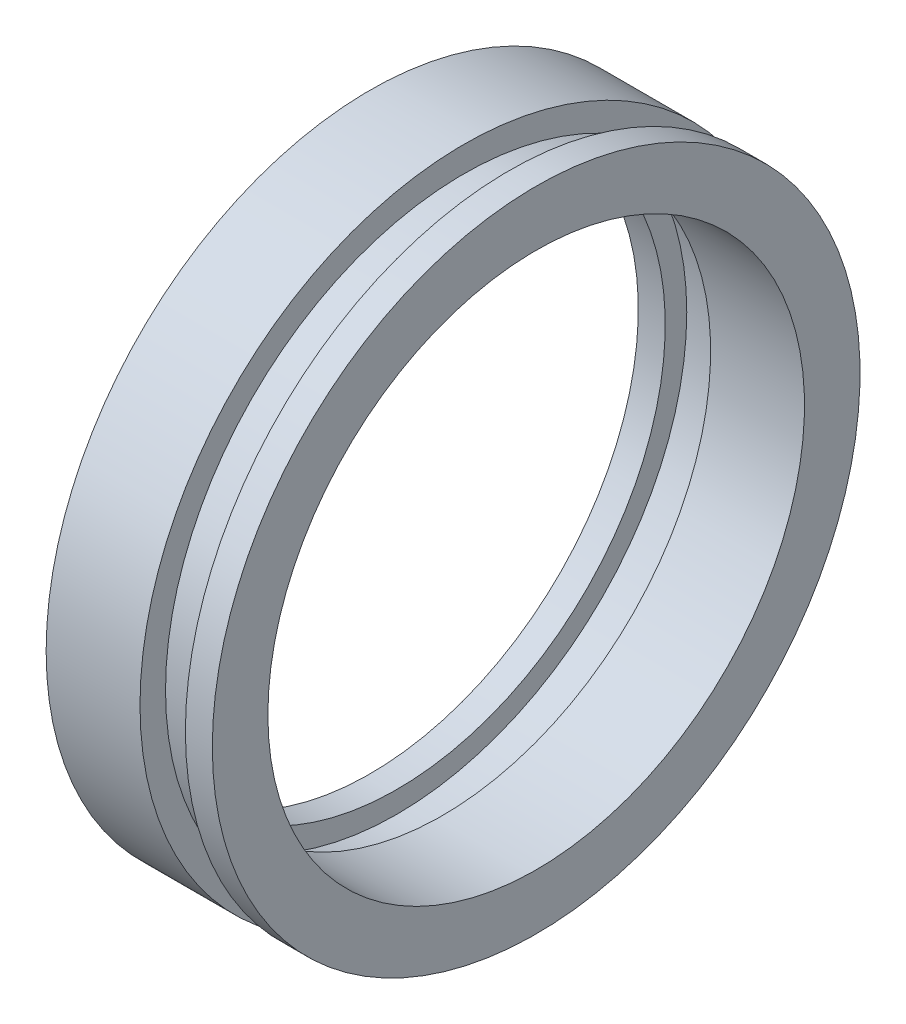
ISO-10303-21;
HEADER;
FILE_DESCRIPTION(('STEP AP214'),'2;1');
FILE_NAME('part.step','',(''),(''),'','','');
FILE_SCHEMA(('AUTOMOTIVE_DESIGN { 1 0 10303 214 1 1 1 1 }'));
ENDSEC;
DATA;
#1=APPLICATION_CONTEXT('core data for automotive mechanical design processes');
#2=APPLICATION_PROTOCOL_DEFINITION('international standard','automotive_design',2000,#1);
#3=PRODUCT_CONTEXT('',#1,'mechanical');
#4=PRODUCT('Part','Part','',(#3));
#5=PRODUCT_RELATED_PRODUCT_CATEGORY('part','',(#4));
#6=PRODUCT_DEFINITION_FORMATION('','',#4);
#7=PRODUCT_DEFINITION_CONTEXT('part definition',#1,'design');
#8=PRODUCT_DEFINITION('design','',#6,#7);
#9=PRODUCT_DEFINITION_SHAPE('','',#8);
#10=(LENGTH_UNIT() NAMED_UNIT(*) SI_UNIT(.MILLI.,.METRE.));
#11=(NAMED_UNIT(*) PLANE_ANGLE_UNIT() SI_UNIT($,.RADIAN.));
#12=(NAMED_UNIT(*) SI_UNIT($,.STERADIAN.) SOLID_ANGLE_UNIT());
#13=UNCERTAINTY_MEASURE_WITH_UNIT(LENGTH_MEASURE(1.E-05),#10,'distance_accuracy_value','');
#14=(GEOMETRIC_REPRESENTATION_CONTEXT(3) GLOBAL_UNCERTAINTY_ASSIGNED_CONTEXT((#13)) GLOBAL_UNIT_ASSIGNED_CONTEXT((#10,
#11,#12)) REPRESENTATION_CONTEXT('',''));
#15=CARTESIAN_POINT('',(0.,0.,0.));
#16=DIRECTION('',(0.,0.,1.));
#17=DIRECTION('',(1.,0.,0.));
#18=AXIS2_PLACEMENT_3D('',#15,#16,#17);
#19=CARTESIAN_POINT('',(0.,0.,0.));
#20=DIRECTION('',(-1.,0.,0.));
#21=DIRECTION('',(0.,0.,1.));
#22=AXIS2_PLACEMENT_3D('',#19,#20,#21);
#23=CYLINDRICAL_SURFACE('',#22,28.829);
#24=CARTESIAN_POINT('',(2.8956,0.,0.));
#25=DIRECTION('',(-1.,0.,0.));
#26=DIRECTION('',(0.,0.,1.));
#27=AXIS2_PLACEMENT_3D('',#24,#25,#26);
#28=CIRCLE('',#27,28.829);
#29=CARTESIAN_POINT('',(2.8956,0.,28.829));
#30=VERTEX_POINT('',#29);
#31=EDGE_CURVE('E76',#30,#30,#28,.T.);
#32=ORIENTED_EDGE('',*,*,#31,.F.);
#33=EDGE_LOOP('',(#32));
#34=FACE_BOUND('',#33,.T.);
#35=CARTESIAN_POINT('',(0.,0.,0.));
#36=DIRECTION('',(-1.,0.,0.));
#37=DIRECTION('',(0.,0.,1.));
#38=AXIS2_PLACEMENT_3D('',#35,#36,#37);
#39=CIRCLE('',#38,28.829);
#40=CARTESIAN_POINT('',(0.,0.,28.829));
#41=VERTEX_POINT('',#40);
#42=EDGE_CURVE('E10',#41,#41,#39,.T.);
#43=ORIENTED_EDGE('',*,*,#42,.T.);
#44=EDGE_LOOP('',(#43));
#45=FACE_BOUND('',#44,.T.);
#46=ADVANCED_FACE('F36',(#34,#45),#23,.F.);
#47=CARTESIAN_POINT('',(0.,28.829,0.));
#48=DIRECTION('',(1.,0.,0.));
#49=DIRECTION('',(0.,0.,-1.));
#50=AXIS2_PLACEMENT_3D('',#47,#48,#49);
#51=PLANE('',#50);
#52=ORIENTED_EDGE('',*,*,#42,.F.);
#53=EDGE_LOOP('',(#52));
#54=FACE_BOUND('',#53,.T.);
#55=CARTESIAN_POINT('',(0.,0.,0.));
#56=DIRECTION('',(-1.,0.,0.));
#57=DIRECTION('',(0.,0.,1.));
#58=AXIS2_PLACEMENT_3D('',#55,#56,#57);
#59=CIRCLE('',#58,34.798);
#60=CARTESIAN_POINT('',(0.,0.,34.798));
#61=VERTEX_POINT('',#60);
#62=EDGE_CURVE('E42',#61,#61,#59,.T.);
#63=ORIENTED_EDGE('',*,*,#62,.T.);
#64=EDGE_LOOP('',(#63));
#65=FACE_BOUND('',#64,.T.);
#66=ADVANCED_FACE('F83',(#54,#65),#51,.F.);
#67=CARTESIAN_POINT('',(0.,0.,0.));
#68=DIRECTION('',(-1.,0.,0.));
#69=DIRECTION('',(0.,0.,1.));
#70=AXIS2_PLACEMENT_3D('',#67,#68,#69);
#71=CYLINDRICAL_SURFACE('',#70,34.798);
#72=ORIENTED_EDGE('',*,*,#62,.F.);
#73=EDGE_LOOP('',(#72));
#74=FACE_BOUND('',#73,.T.);
#75=CARTESIAN_POINT('',(10.0838,0.,0.));
#76=DIRECTION('',(-1.,0.,0.));
#77=DIRECTION('',(0.,0.,1.));
#78=AXIS2_PLACEMENT_3D('',#75,#76,#77);
#79=CIRCLE('',#78,34.798);
#80=CARTESIAN_POINT('',(10.0838,0.,34.798));
#81=VERTEX_POINT('',#80);
#82=EDGE_CURVE('E46',#81,#81,#79,.T.);
#83=ORIENTED_EDGE('',*,*,#82,.T.);
#84=EDGE_LOOP('',(#83));
#85=FACE_BOUND('',#84,.T.);
#86=ADVANCED_FACE('F87',(#74,#85),#71,.T.);
#87=CARTESIAN_POINT('',(10.0838,34.798,0.));
#88=DIRECTION('',(-1.,0.,0.));
#89=DIRECTION('',(0.,0.,1.));
#90=AXIS2_PLACEMENT_3D('',#87,#88,#89);
#91=PLANE('',#90);
#92=ORIENTED_EDGE('',*,*,#82,.F.);
#93=EDGE_LOOP('',(#92));
#94=FACE_BOUND('',#93,.T.);
#95=CARTESIAN_POINT('',(10.0838,0.,0.));
#96=DIRECTION('',(-1.,0.,0.));
#97=DIRECTION('',(0.,0.,1.));
#98=AXIS2_PLACEMENT_3D('',#95,#96,#97);
#99=CIRCLE('',#98,32.0548);
#100=CARTESIAN_POINT('',(10.0838,0.,32.0548));
#101=VERTEX_POINT('',#100);
#102=EDGE_CURVE('E50',#101,#101,#99,.T.);
#103=ORIENTED_EDGE('',*,*,#102,.T.);
#104=EDGE_LOOP('',(#103));
#105=FACE_BOUND('',#104,.T.);
#106=ADVANCED_FACE('F92',(#94,#105),#91,.F.);
#107=CARTESIAN_POINT('',(0.,0.,0.));
#108=DIRECTION('',(-1.,0.,0.));
#109=DIRECTION('',(0.,0.,1.));
#110=AXIS2_PLACEMENT_3D('',#107,#108,#109);
#111=CYLINDRICAL_SURFACE('',#110,32.0548);
#112=ORIENTED_EDGE('',*,*,#102,.F.);
#113=EDGE_LOOP('',(#112));
#114=FACE_BOUND('',#113,.T.);
#115=CARTESIAN_POINT('',(14.9606,0.,0.));
#116=DIRECTION('',(-1.,0.,0.));
#117=DIRECTION('',(0.,0.,1.));
#118=AXIS2_PLACEMENT_3D('',#115,#116,#117);
#119=CIRCLE('',#118,32.0548);
#120=CARTESIAN_POINT('',(14.9606,0.,32.0548));
#121=VERTEX_POINT('',#120);
#122=EDGE_CURVE('E55',#121,#121,#119,.T.);
#123=ORIENTED_EDGE('',*,*,#122,.T.);
#124=EDGE_LOOP('',(#123));
#125=FACE_BOUND('',#124,.T.);
#126=ADVANCED_FACE('F98',(#114,#125),#111,.T.);
#127=CARTESIAN_POINT('',(14.9606,32.0548,0.));
#128=DIRECTION('',(1.,0.,0.));
#129=DIRECTION('',(0.,0.,-1.));
#130=AXIS2_PLACEMENT_3D('',#127,#128,#129);
#131=PLANE('',#130);
#132=ORIENTED_EDGE('',*,*,#122,.F.);
#133=EDGE_LOOP('',(#132));
#134=FACE_BOUND('',#133,.T.);
#135=CARTESIAN_POINT('',(14.9606,0.,0.));
#136=DIRECTION('',(-1.,0.,0.));
#137=DIRECTION('',(0.,0.,1.));
#138=AXIS2_PLACEMENT_3D('',#135,#136,#137);
#139=CIRCLE('',#138,34.798);
#140=CARTESIAN_POINT('',(14.9606,0.,34.798));
#141=VERTEX_POINT('',#140);
#142=EDGE_CURVE('E58',#141,#141,#139,.T.);
#143=ORIENTED_EDGE('',*,*,#142,.T.);
#144=EDGE_LOOP('',(#143));
#145=FACE_BOUND('',#144,.T.);
#146=ADVANCED_FACE('F102',(#134,#145),#131,.F.);
#147=CARTESIAN_POINT('',(0.,0.,0.));
#148=DIRECTION('',(-1.,0.,0.));
#149=DIRECTION('',(0.,0.,1.));
#150=AXIS2_PLACEMENT_3D('',#147,#148,#149);
#151=CYLINDRICAL_SURFACE('',#150,34.798);
#152=ORIENTED_EDGE('',*,*,#142,.F.);
#153=EDGE_LOOP('',(#152));
#154=FACE_BOUND('',#153,.T.);
#155=CARTESIAN_POINT('',(17.8562,0.,0.));
#156=DIRECTION('',(-1.,0.,0.));
#157=DIRECTION('',(0.,0.,1.));
#158=AXIS2_PLACEMENT_3D('',#155,#156,#157);
#159=CIRCLE('',#158,34.798);
#160=CARTESIAN_POINT('',(17.8562,0.,34.798));
#161=VERTEX_POINT('',#160);
#162=EDGE_CURVE('E61',#161,#161,#159,.T.);
#163=ORIENTED_EDGE('',*,*,#162,.T.);
#164=EDGE_LOOP('',(#163));
#165=FACE_BOUND('',#164,.T.);
#166=ADVANCED_FACE('F106',(#154,#165),#151,.T.);
#167=CARTESIAN_POINT('',(17.8562,34.798,0.));
#168=DIRECTION('',(-1.,0.,0.));
#169=DIRECTION('',(0.,0.,1.));
#170=AXIS2_PLACEMENT_3D('',#167,#168,#169);
#171=PLANE('',#170);
#172=ORIENTED_EDGE('',*,*,#162,.F.);
#173=EDGE_LOOP('',(#172));
#174=FACE_BOUND('',#173,.T.);
#175=CARTESIAN_POINT('',(17.8562,0.,0.));
#176=DIRECTION('',(-1.,0.,0.));
#177=DIRECTION('',(0.,0.,1.));
#178=AXIS2_PLACEMENT_3D('',#175,#176,#177);
#179=CIRCLE('',#178,28.829);
#180=CARTESIAN_POINT('',(17.8562,0.,28.829));
#181=VERTEX_POINT('',#180);
#182=EDGE_CURVE('E64',#181,#181,#179,.T.);
#183=ORIENTED_EDGE('',*,*,#182,.T.);
#184=EDGE_LOOP('',(#183));
#185=FACE_BOUND('',#184,.T.);
#186=ADVANCED_FACE('F110',(#174,#185),#171,.F.);
#187=CARTESIAN_POINT('',(0.,0.,0.));
#188=DIRECTION('',(-1.,0.,0.));
#189=DIRECTION('',(0.,0.,1.));
#190=AXIS2_PLACEMENT_3D('',#187,#188,#189);
#191=CYLINDRICAL_SURFACE('',#190,28.829);
#192=ORIENTED_EDGE('',*,*,#182,.F.);
#193=EDGE_LOOP('',(#192));
#194=FACE_BOUND('',#193,.T.);
#195=CARTESIAN_POINT('',(7.7724,0.,0.));
#196=DIRECTION('',(-1.,0.,0.));
#197=DIRECTION('',(0.,0.,1.));
#198=AXIS2_PLACEMENT_3D('',#195,#196,#197);
#199=CIRCLE('',#198,28.829);
#200=CARTESIAN_POINT('',(7.7724,0.,28.829));
#201=VERTEX_POINT('',#200);
#202=EDGE_CURVE('E67',#201,#201,#199,.T.);
#203=ORIENTED_EDGE('',*,*,#202,.T.);
#204=EDGE_LOOP('',(#203));
#205=FACE_BOUND('',#204,.T.);
#206=ADVANCED_FACE('F114',(#194,#205),#191,.F.);
#207=CARTESIAN_POINT('',(7.7724,28.829,0.));
#208=DIRECTION('',(1.,0.,0.));
#209=DIRECTION('',(0.,0.,-1.));
#210=AXIS2_PLACEMENT_3D('',#207,#208,#209);
#211=PLANE('',#210);
#212=ORIENTED_EDGE('',*,*,#202,.F.);
#213=EDGE_LOOP('',(#212));
#214=FACE_BOUND('',#213,.T.);
#215=CARTESIAN_POINT('',(7.7724,0.,0.));
#216=DIRECTION('',(-1.,0.,0.));
#217=DIRECTION('',(0.,0.,1.));
#218=AXIS2_PLACEMENT_3D('',#215,#216,#217);
#219=CIRCLE('',#218,31.1404);
#220=CARTESIAN_POINT('',(7.7724,0.,31.1404));
#221=VERTEX_POINT('',#220);
#222=EDGE_CURVE('E70',#221,#221,#219,.T.);
#223=ORIENTED_EDGE('',*,*,#222,.T.);
#224=EDGE_LOOP('',(#223));
#225=FACE_BOUND('',#224,.T.);
#226=ADVANCED_FACE('F118',(#214,#225),#211,.F.);
#227=CARTESIAN_POINT('',(0.,0.,0.));
#228=DIRECTION('',(-1.,0.,0.));
#229=DIRECTION('',(0.,0.,1.));
#230=AXIS2_PLACEMENT_3D('',#227,#228,#229);
#231=CYLINDRICAL_SURFACE('',#230,31.1404);
#232=ORIENTED_EDGE('',*,*,#222,.F.);
#233=EDGE_LOOP('',(#232));
#234=FACE_BOUND('',#233,.T.);
#235=CARTESIAN_POINT('',(2.8956,0.,0.));
#236=DIRECTION('',(-1.,0.,0.));
#237=DIRECTION('',(0.,0.,1.));
#238=AXIS2_PLACEMENT_3D('',#235,#236,#237);
#239=CIRCLE('',#238,31.1404);
#240=CARTESIAN_POINT('',(2.8956,0.,31.1404));
#241=VERTEX_POINT('',#240);
#242=EDGE_CURVE('E73',#241,#241,#239,.T.);
#243=ORIENTED_EDGE('',*,*,#242,.T.);
#244=EDGE_LOOP('',(#243));
#245=FACE_BOUND('',#244,.T.);
#246=ADVANCED_FACE('F122',(#234,#245),#231,.F.);
#247=CARTESIAN_POINT('',(2.8956,31.1404,0.));
#248=DIRECTION('',(-1.,0.,0.));
#249=DIRECTION('',(0.,0.,1.));
#250=AXIS2_PLACEMENT_3D('',#247,#248,#249);
#251=PLANE('',#250);
#252=ORIENTED_EDGE('',*,*,#242,.F.);
#253=EDGE_LOOP('',(#252));
#254=FACE_BOUND('',#253,.T.);
#255=ORIENTED_EDGE('',*,*,#31,.T.);
#256=EDGE_LOOP('',(#255));
#257=FACE_BOUND('',#256,.T.);
#258=ADVANCED_FACE('F80',(#254,#257),#251,.F.);
#259=CLOSED_SHELL('',(#46,#66,#86,#106,#126,#146,#166,#186,#206,#226,#246,#258));
#260=MANIFOLD_SOLID_BREP('B2',#259);
#261=ADVANCED_BREP_SHAPE_REPRESENTATION('',(#18,#260),#14);
#262=SHAPE_DEFINITION_REPRESENTATION(#9,#261);
ENDSEC;
END-ISO-10303-21;
